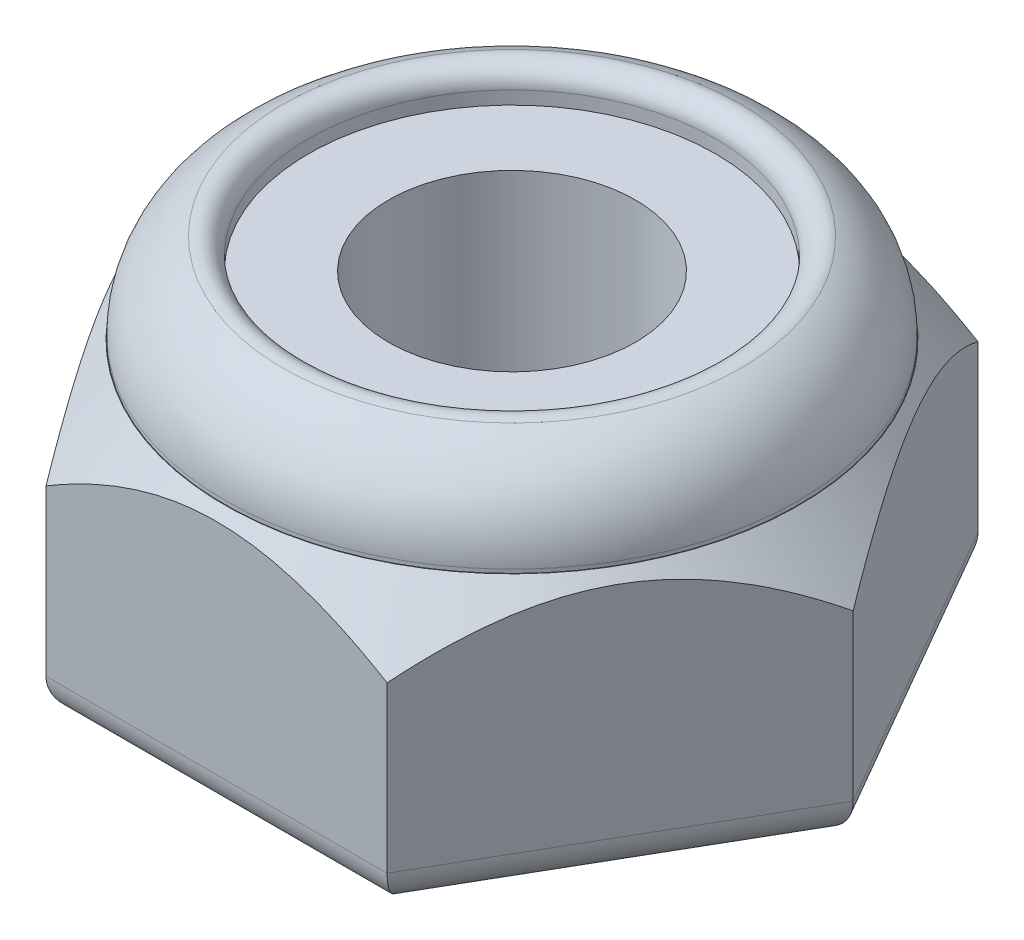
ISO-10303-21;
HEADER;
FILE_DESCRIPTION(('STEP AP214'),'2;1');
FILE_NAME('part.step','',(''),(''),'','','');
FILE_SCHEMA(('AUTOMOTIVE_DESIGN { 1 0 10303 214 1 1 1 1 }'));
ENDSEC;
DATA;
#1=APPLICATION_CONTEXT('core data for automotive mechanical design processes');
#2=APPLICATION_PROTOCOL_DEFINITION('international standard','automotive_design',2000,#1);
#3=PRODUCT_CONTEXT('',#1,'mechanical');
#4=PRODUCT('Part','Part','',(#3));
#5=PRODUCT_RELATED_PRODUCT_CATEGORY('part','',(#4));
#6=PRODUCT_DEFINITION_FORMATION('','',#4);
#7=PRODUCT_DEFINITION_CONTEXT('part definition',#1,'design');
#8=PRODUCT_DEFINITION('design','',#6,#7);
#9=PRODUCT_DEFINITION_SHAPE('','',#8);
#10=(LENGTH_UNIT() NAMED_UNIT(*) SI_UNIT(.MILLI.,.METRE.));
#11=(NAMED_UNIT(*) PLANE_ANGLE_UNIT() SI_UNIT($,.RADIAN.));
#12=(NAMED_UNIT(*) SI_UNIT($,.STERADIAN.) SOLID_ANGLE_UNIT());
#13=UNCERTAINTY_MEASURE_WITH_UNIT(LENGTH_MEASURE(1.E-05),#10,'distance_accuracy_value','');
#14=(GEOMETRIC_REPRESENTATION_CONTEXT(3) GLOBAL_UNCERTAINTY_ASSIGNED_CONTEXT((#13)) GLOBAL_UNIT_ASSIGNED_CONTEXT((#10,
#11,#12)) REPRESENTATION_CONTEXT('',''));
#15=CARTESIAN_POINT('',(0.,0.,0.));
#16=DIRECTION('',(0.,0.,1.));
#17=DIRECTION('',(1.,0.,0.));
#18=AXIS2_PLACEMENT_3D('',#15,#16,#17);
#19=CARTESIAN_POINT('',(0.,4.9784,0.));
#20=DIRECTION('',(0.,-1.,0.));
#21=DIRECTION('',(0.,0.,-1.));
#22=AXIS2_PLACEMENT_3D('',#19,#20,#21);
#23=CYLINDRICAL_SURFACE('',#22,3.937);
#24=CARTESIAN_POINT('',(0.,3.7084,0.));
#25=DIRECTION('',(0.,1.,0.));
#26=DIRECTION('',(0.,0.,1.));
#27=AXIS2_PLACEMENT_3D('',#24,#25,#26);
#28=CIRCLE('',#27,3.937);
#29=CARTESIAN_POINT('',(0.,3.7084,3.937));
#30=VERTEX_POINT('',#29);
#31=EDGE_CURVE('E249',#30,#30,#28,.T.);
#32=ORIENTED_EDGE('',*,*,#31,.F.);
#33=EDGE_LOOP('',(#32));
#34=FACE_BOUND('',#33,.T.);
#35=CARTESIAN_POINT('',(0.,3.6576,0.));
#36=DIRECTION('',(0.,-1.,0.));
#37=DIRECTION('',(0.,0.,-1.));
#38=AXIS2_PLACEMENT_3D('',#35,#36,#37);
#39=CIRCLE('',#38,3.937);
#40=CARTESIAN_POINT('',(0.,3.6576,-3.937));
#41=VERTEX_POINT('',#40);
#42=EDGE_CURVE('E19',#41,#41,#39,.F.);
#43=ORIENTED_EDGE('',*,*,#42,.T.);
#44=EDGE_LOOP('',(#43));
#45=FACE_BOUND('',#44,.T.);
#46=ADVANCED_FACE('F16',(#34,#45),#23,.T.);
#47=CARTESIAN_POINT('',(0.,3.7084,0.));
#48=DIRECTION('',(0.,1.,0.));
#49=DIRECTION('',(0.,0.,1.));
#50=AXIS2_PLACEMENT_3D('',#47,#48,#49);
#51=TOROIDAL_SURFACE('',#50,2.667,1.27);
#52=ORIENTED_EDGE('',*,*,#31,.T.);
#53=EDGE_LOOP('',(#52));
#54=FACE_BOUND('',#53,.T.);
#55=CARTESIAN_POINT('',(0.,4.88572150982644,0.));
#56=DIRECTION('',(0.,-1.,0.));
#57=DIRECTION('',(0.,0.,-1.));
#58=AXIS2_PLACEMENT_3D('',#55,#56,#57);
#59=CIRCLE('',#58,3.14325);
#60=CARTESIAN_POINT('',(0.,4.88572150982644,-3.14325));
#61=VERTEX_POINT('',#60);
#62=EDGE_CURVE('E243',#61,#61,#59,.F.);
#63=ORIENTED_EDGE('',*,*,#62,.F.);
#64=EDGE_LOOP('',(#63));
#65=FACE_BOUND('',#64,.T.);
#66=ADVANCED_FACE('F134',(#54,#65),#51,.T.);
#67=CARTESIAN_POINT('',(2.34315,3.6576,4.05845484975502));
#68=DIRECTION('',(0.,-1.,0.));
#69=DIRECTION('',(0.,0.,-1.));
#70=AXIS2_PLACEMENT_3D('',#67,#68,#69);
#71=PLANE('',#70);
#72=ORIENTED_EDGE('',*,*,#42,.F.);
#73=EDGE_LOOP('',(#72));
#74=FACE_BOUND('',#73,.T.);
#75=CARTESIAN_POINT('',(0.,3.65760000011051,0.));
#76=DIRECTION('',(0.,-1.,0.));
#77=DIRECTION('',(0.,0.,-1.));
#78=AXIS2_PLACEMENT_3D('',#75,#76,#77);
#79=CIRCLE('',#78,3.94407100938664);
#80=CARTESIAN_POINT('',(0.,3.65760000011051,-3.94407100938664));
#81=VERTEX_POINT('',#80);
#82=EDGE_CURVE('E119',#81,#81,#79,.T.);
#83=ORIENTED_EDGE('',*,*,#82,.F.);
#84=EDGE_LOOP('',(#83));
#85=FACE_BOUND('',#84,.T.);
#86=ADVANCED_FACE('F129',(#74,#85),#71,.F.);
#87=CARTESIAN_POINT('',(0.,4.65025720786115,0.));
#88=DIRECTION('',(0.,-1.,0.));
#89=DIRECTION('',(0.,0.,-1.));
#90=AXIS2_PLACEMENT_3D('',#87,#88,#89);
#91=TOROIDAL_SURFACE('',#90,3.048,0.254);
#92=CARTESIAN_POINT('',(0.,4.65025720786115,0.));
#93=DIRECTION('',(0.,1.,0.));
#94=DIRECTION('',(0.,0.,1.));
#95=AXIS2_PLACEMENT_3D('',#92,#93,#94);
#96=CIRCLE('',#95,2.794);
#97=CARTESIAN_POINT('',(0.,4.65025720786115,2.794));
#98=VERTEX_POINT('',#97);
#99=EDGE_CURVE('E104',#98,#98,#96,.F.);
#100=ORIENTED_EDGE('',*,*,#99,.T.);
#101=EDGE_LOOP('',(#100));
#102=FACE_BOUND('',#101,.T.);
#103=ORIENTED_EDGE('',*,*,#62,.T.);
#104=EDGE_LOOP('',(#103));
#105=FACE_BOUND('',#104,.T.);
#106=ADVANCED_FACE('F125',(#102,#105),#91,.T.);
#107=CARTESIAN_POINT('',(0.,2.76773860969115,0.));
#108=DIRECTION('',(0.,-1.,0.));
#109=DIRECTION('',(0.,0.,-1.));
#110=AXIS2_PLACEMENT_3D('',#107,#108,#109);
#111=CONICAL_SURFACE('',#110,4.69075337389313,0.698131700802158);
#112=CARTESIAN_POINT('',(-4.68630000001476,2.77304593398821,-5.3333815551093E-11));
#113=CARTESIAN_POINT('',(-4.65177717141793,2.81418235889091,0.0597952931149053));
#114=CARTESIAN_POINT('',(-4.61695780288956,2.85432113110728,0.120104208500933));
#115=CARTESIAN_POINT('',(-4.54666264441453,2.93230661020916,0.241858994511412));
#116=CARTESIAN_POINT('',(-4.51118655194523,2.97015222462005,0.303305389120424));
#117=CARTESIAN_POINT('',(-4.40329561885259,3.08018701500149,0.490177966909938));
#118=CARTESIAN_POINT('',(-4.32983334004397,3.14837015576205,0.617418366247689));
#119=CARTESIAN_POINT('',(-4.1797796499728,3.27092778609509,0.877318981315214));
#120=CARTESIAN_POINT('',(-4.10317943932402,3.32525984886677,1.00999443802899));
#121=CARTESIAN_POINT('',(-3.94747591651278,3.41577217646147,1.27968085045525));
#122=CARTESIAN_POINT('',(-3.86837998243724,3.45200143013375,1.4166790269463));
#123=CARTESIAN_POINT('',(-3.73746585196202,3.49372811243502,1.64342895235813));
#124=CARTESIAN_POINT('',(-3.68614686019516,3.50560413715319,1.73231605349153));
#125=CARTESIAN_POINT('',(-3.58316406708587,3.52008140702852,1.91068748346216));
#126=CARTESIAN_POINT('',(-3.53150020834088,3.5226810675312,2.00017191172355));
#127=CARTESIAN_POINT('',(-3.42855034551142,3.51847006524789,2.17848630477643));
#128=CARTESIAN_POINT('',(-3.3772638088531,3.51171021118305,2.26731719201287));
#129=CARTESIAN_POINT('',(-3.27519197708947,3.48921023555424,2.4441107906491));
#130=CARTESIAN_POINT('',(-3.22440670715057,3.4734696654174,2.53207345845939));
#131=CARTESIAN_POINT('',(-3.10963060134479,3.42817062222156,2.73087150520989));
#132=CARTESIAN_POINT('',(-3.04589899577138,3.39598542076133,2.84125788411098));
#133=CARTESIAN_POINT('',(-2.92018166739655,3.32004827846255,3.05900668424801));
#134=CARTESIAN_POINT('',(-2.85819691962206,3.27629001415058,3.16636741668776));
#135=CARTESIAN_POINT('',(-2.735889068299,3.17910361386979,3.37821082934389));
#136=CARTESIAN_POINT('',(-2.67557364738244,3.12563730731956,3.48268020285126));
#137=CARTESIAN_POINT('',(-2.55683004320588,3.01104764609313,3.68835015835892));
#138=CARTESIAN_POINT('',(-2.49840123089761,2.94992687749399,3.78955182990274));
#139=CARTESIAN_POINT('',(-2.42439626092569,2.86741854625153,3.91773219790672));
#140=CARTESIAN_POINT('',(-2.40802320106583,2.84883596648691,3.94609116945937));
#141=CARTESIAN_POINT('',(-2.3754621576302,2.81125673907332,4.00248855103733));
#142=CARTESIAN_POINT('',(-2.35927376441604,2.79226151161516,4.03052767057717));
#143=CARTESIAN_POINT('',(-2.3431499999717,2.77304593399368,4.05845484980404));
#144=B_SPLINE_CURVE_WITH_KNOTS('',3,(#112,#113,#114,#115,#116,#117,#118,#119,#120,#121,#122,
#123,#124,#125,#126,#127,#128,#129,#130,#131,#132,#133,#134,#135,#136,#137,#138,#139,#140,#141,
#142,#143),.UNSPECIFIED.,.F.,.F.,(4,2,2,2,2,2,2,2,2,2,2,2,2,2,2,4),(0.,0.241096809088565,
0.48230758945251,0.967637153847365,1.45443592242802,1.93991010956963,2.24950193433618,
2.5591466432483,2.86711700071403,3.17510274216898,3.56882084711336,3.96275452403261,
4.35827201930639,4.75365624679115,4.86660838982693,4.97921936905084),.UNSPECIFIED.);
#145=CARTESIAN_POINT('',(-4.68630000002839,2.77304593399358,0.));
#146=VERTEX_POINT('',#145);
#147=CARTESIAN_POINT('',(-2.34315000001419,2.77304593399358,4.05845484977959));
#148=VERTEX_POINT('',#147);
#149=EDGE_CURVE('E91',#146,#148,#144,.T.);
#150=ORIENTED_EDGE('',*,*,#149,.T.);
#151=CARTESIAN_POINT('',(-2.34315000005357,2.77304593398822,4.05845484974113));
#152=CARTESIAN_POINT('',(-2.27415972170409,2.81414935271336,4.05845484974989));
#153=CARTESIAN_POINT('',(-2.20457738522044,2.85425669884705,4.05845484975361));
#154=CARTESIAN_POINT('',(-2.06410193528096,2.93218331968193,4.05845484975642));
#155=CARTESIAN_POINT('',(-1.99320821641151,2.9700015013142,4.05845484975551));
#156=CARTESIAN_POINT('',(-1.77754688772429,3.07999086386455,4.05845484975401));
#157=CARTESIAN_POINT('',(-1.63068545869954,3.1481589403704,4.05845484975469));
#158=CARTESIAN_POINT('',(-1.33052752457963,3.27077676919262,4.05845484975534));
#159=CARTESIAN_POINT('',(-1.17720631609342,3.32516696804196,4.0584548497553));
#160=CARTESIAN_POINT('',(-0.865613503807779,3.41574608766059,4.05845484975473));
#161=CARTESIAN_POINT('',(-0.707359229311903,3.45199244874899,4.0584548497542));
#162=CARTESIAN_POINT('',(-0.456822143345071,3.49192146546895,4.05845484975548));
#163=CARTESIAN_POINT('',(-0.365672921156202,3.50290887295604,4.05845484975637));
#164=CARTESIAN_POINT('',(-0.183016322004482,3.51758027913678,4.05845484975366));
#165=CARTESIAN_POINT('',(-0.0915105175250817,3.52128341037061,4.05845484975007));
#166=CARTESIAN_POINT('',(0.104649468641441,3.52128177491765,4.0584548497495));
#167=CARTESIAN_POINT('',(0.209305100872023,3.51643705333648,4.05845484975354));
#168=CARTESIAN_POINT('',(0.417787181909869,3.49730239560235,4.05845484975649));
#169=CARTESIAN_POINT('',(0.521613181352877,3.48300765111694,4.05845484975541));
#170=CARTESIAN_POINT('',(0.728332544913562,3.44553375886282,4.05845484975462));
#171=CARTESIAN_POINT('',(0.831215331558566,3.42229697724238,4.05845484975491));
#172=CARTESIAN_POINT('',(1.03487580391125,3.36791830054733,4.05845484975512));
#173=CARTESIAN_POINT('',(1.13565289468809,3.33677420321768,4.05845484975504));
#174=CARTESIAN_POINT('',(1.33273383822163,3.26838741918099,4.05845484975499));
#175=CARTESIAN_POINT('',(1.42908716226035,3.23128582684656,4.05845484975501));
#176=CARTESIAN_POINT('',(1.61947291708309,3.15151071591982,4.05845484975502));
#177=CARTESIAN_POINT('',(1.71350470709807,3.10883567899407,4.05845484975502));
#178=CARTESIAN_POINT('',(1.89803195382395,3.01941532331662,4.05845484975501));
#179=CARTESIAN_POINT('',(1.98855798046432,2.97273255726059,4.05845484975502));
#180=CARTESIAN_POINT('',(2.16742834958163,2.87556944084479,4.05845484975502));
#181=CARTESIAN_POINT('',(2.25577492892455,2.82509321932285,4.05845484975502));
#182=CARTESIAN_POINT('',(2.34315000005566,2.77304593399424,4.05845484975502));
#183=B_SPLINE_CURVE_WITH_KNOTS('',3,(#151,#152,#153,#154,#155,#156,#157,#158,#159,#160,#161,
#162,#163,#164,#165,#166,#167,#168,#169,#170,#171,#172,#173,#174,#175,#176,#177,#178,#179,#180,
#181,#182),.UNSPECIFIED.,.F.,.F.,(4,2,2,2,2,2,2,2,2,2,2,2,2,2,2,4),(0.,0.24090330355952,
0.481920744736242,0.967059466968448,1.4542606837498,1.93990959177135,2.21507934695766,
2.4895253838939,2.80337599596431,3.11738642360394,3.43345557972405,3.74961286055439,
4.0591611810716,4.36879400620232,4.67425708545867,4.97939238068026),.UNSPECIFIED.);
#184=CARTESIAN_POINT('',(2.34315000001419,2.77304593399358,4.05845484977959));
#185=VERTEX_POINT('',#184);
#186=EDGE_CURVE('E83',#148,#185,#183,.T.);
#187=ORIENTED_EDGE('',*,*,#186,.T.);
#188=CARTESIAN_POINT('',(2.3431499999612,2.77304593398822,4.05845484979446));
#189=CARTESIAN_POINT('',(2.37767282857321,2.81418235889091,3.99865955663499));
#190=CARTESIAN_POINT('',(2.41249219710801,2.85432113110729,3.93835064125267));
#191=CARTESIAN_POINT('',(2.48278735558791,2.93230661020917,3.816595855245));
#192=CARTESIAN_POINT('',(2.51826344805563,2.97015222462005,3.75514946063508));
#193=CARTESIAN_POINT('',(2.62615438114571,3.08018701500149,3.56827688284408));
#194=CARTESIAN_POINT('',(2.69961665995557,3.14837015576206,3.44103648350706));
#195=CARTESIAN_POINT('',(2.84967035002766,3.2709277860951,3.18113586844006));
#196=CARTESIAN_POINT('',(2.9262705606761,3.32525984886677,3.04846041172609));
#197=CARTESIAN_POINT('',(3.08197408348711,3.41577217646148,2.77877399929969));
#198=CARTESIAN_POINT('',(3.16107001756274,3.45200143013376,2.64177582280869));
#199=CARTESIAN_POINT('',(3.291984148038,3.49372811243503,2.41502589739689));
#200=CARTESIAN_POINT('',(3.34330313980485,3.50560413715319,2.32613879626348));
#201=CARTESIAN_POINT('',(3.44628593291413,3.52008140702853,2.14776736629285));
#202=CARTESIAN_POINT('',(3.49794979165912,3.52268106753121,2.05828293803146));
#203=CARTESIAN_POINT('',(3.60089965448859,3.51847006524789,1.87996854497858));
#204=CARTESIAN_POINT('',(3.6521861911469,3.51171021118306,1.79113765774214));
#205=CARTESIAN_POINT('',(3.75425802291053,3.48921023555425,1.61434405910591));
#206=CARTESIAN_POINT('',(3.80504329284943,3.47346966541741,1.52638139129562));
#207=CARTESIAN_POINT('',(3.91981939865521,3.42817062222156,1.32758334454512));
#208=CARTESIAN_POINT('',(3.98355100422862,3.39598542076133,1.21719696564403));
#209=CARTESIAN_POINT('',(4.10926833260345,3.32004827846255,0.999448165506999));
#210=CARTESIAN_POINT('',(4.17125308037794,3.27629001415058,0.892087433067251));
#211=CARTESIAN_POINT('',(4.293560931701,3.17910361386979,0.680244020411125));
#212=CARTESIAN_POINT('',(4.35387635261756,3.12563730731956,0.575774646903749));
#213=CARTESIAN_POINT('',(4.47261995679412,3.01104764609313,0.370104691396086));
#214=CARTESIAN_POINT('',(4.53104876910239,2.94992687749399,0.268903019852268));
#215=CARTESIAN_POINT('',(4.60505373907431,2.86741854625153,0.140722651848287));
#216=CARTESIAN_POINT('',(4.62142679893417,2.84883596648691,0.112363680295636));
#217=CARTESIAN_POINT('',(4.6539878423698,2.81125673907332,0.055966298717677));
#218=CARTESIAN_POINT('',(4.67017623558396,2.79226151161516,0.0279271791778412));
#219=CARTESIAN_POINT('',(4.6863000000283,2.77304593399368,-4.90273860582746E-11));
#220=B_SPLINE_CURVE_WITH_KNOTS('',3,(#188,#189,#190,#191,#192,#193,#194,#195,#196,#197,#198,
#199,#200,#201,#202,#203,#204,#205,#206,#207,#208,#209,#210,#211,#212,#213,#214,#215,#216,#217,
#218,#219),.UNSPECIFIED.,.F.,.F.,(4,2,2,2,2,2,2,2,2,2,2,2,2,2,2,4),(0.,0.241096809088565,
0.48230758945251,0.967637153847363,1.45443592242802,1.93991010956962,2.24950193433617,
2.5591466432483,2.86711700071402,3.17510274216897,3.56882084711335,3.9627545240326,
4.35827201930639,4.75365624679114,4.86660838982692,4.97921936905084),.UNSPECIFIED.);
#221=CARTESIAN_POINT('',(4.68630000001419,2.7730459340105,-2.45821360759307E-11));
#222=VERTEX_POINT('',#221);
#223=EDGE_CURVE('E88',#185,#222,#220,.T.);
#224=ORIENTED_EDGE('',*,*,#223,.T.);
#225=CARTESIAN_POINT('',(4.68630000001476,2.77304593398822,5.33267015141622E-11));
#226=CARTESIAN_POINT('',(4.65177717141792,2.81418235889091,-0.0597952931149122));
#227=CARTESIAN_POINT('',(4.61695780288956,2.85432113110729,-0.12010420850094));
#228=CARTESIAN_POINT('',(4.54666264441452,2.93230661020917,-0.241858994511418));
#229=CARTESIAN_POINT('',(4.51118655194522,2.97015222462005,-0.303305389120429));
#230=CARTESIAN_POINT('',(4.40329561885258,3.0801870150015,-0.490177966909942));
#231=CARTESIAN_POINT('',(4.32983334004397,3.14837015576206,-0.617418366247694));
#232=CARTESIAN_POINT('',(4.1797796499728,3.27092778609509,-0.877318981315217));
#233=CARTESIAN_POINT('',(4.10317943932402,3.32525984886677,-1.00999443802899));
#234=CARTESIAN_POINT('',(3.94747591651277,3.41577217646148,-1.27968085045525));
#235=CARTESIAN_POINT('',(3.86837998243724,3.45200143013375,-1.4166790269463));
#236=CARTESIAN_POINT('',(3.73746585196202,3.49372811243502,-1.64342895235813));
#237=CARTESIAN_POINT('',(3.68614686019516,3.50560413715319,-1.73231605349153));
#238=CARTESIAN_POINT('',(3.58316406708587,3.52008140702852,-1.91068748346216));
#239=CARTESIAN_POINT('',(3.53150020834088,3.5226810675312,-2.00017191172355));
#240=CARTESIAN_POINT('',(3.42855034551142,3.51847006524789,-2.17848630477643));
#241=CARTESIAN_POINT('',(3.3772638088531,3.51171021118306,-2.26731719201287));
#242=CARTESIAN_POINT('',(3.27519197708948,3.48921023555424,-2.4441107906491));
#243=CARTESIAN_POINT('',(3.22440670715057,3.4734696654174,-2.53207345845939));
#244=CARTESIAN_POINT('',(3.10963060134479,3.42817062222156,-2.73087150520989));
#245=CARTESIAN_POINT('',(3.04589899577138,3.39598542076133,-2.84125788411098));
#246=CARTESIAN_POINT('',(2.92018166739655,3.32004827846255,-3.05900668424801));
#247=CARTESIAN_POINT('',(2.85819691962206,3.27629001415058,-3.16636741668776));
#248=CARTESIAN_POINT('',(2.735889068299,3.17910361386979,-3.37821082934388));
#249=CARTESIAN_POINT('',(2.67557364738245,3.12563730731956,-3.48268020285126));
#250=CARTESIAN_POINT('',(2.55683004320588,3.01104764609313,-3.68835015835892));
#251=CARTESIAN_POINT('',(2.49840123089762,2.94992687749399,-3.78955182990274));
#252=CARTESIAN_POINT('',(2.42439626092569,2.86741854625153,-3.91773219790672));
#253=CARTESIAN_POINT('',(2.40802320106583,2.84883596648691,-3.94609116945937));
#254=CARTESIAN_POINT('',(2.3754621576302,2.81125673907332,-4.00248855103733));
#255=CARTESIAN_POINT('',(2.35927376441604,2.79226151161516,-4.03052767057717));
#256=CARTESIAN_POINT('',(2.3431499999717,2.77304593399368,-4.05845484980404));
#257=B_SPLINE_CURVE_WITH_KNOTS('',3,(#225,#226,#227,#228,#229,#230,#231,#232,#233,#234,#235,
#236,#237,#238,#239,#240,#241,#242,#243,#244,#245,#246,#247,#248,#249,#250,#251,#252,#253,#254,
#255,#256),.UNSPECIFIED.,.F.,.F.,(4,2,2,2,2,2,2,2,2,2,2,2,2,2,2,4),(0.,0.241096809088564,
0.482307589452508,0.96763715384736,1.45443592242801,1.93991010956962,2.24950193433616,
2.55914664324829,2.86711700071401,3.17510274216896,3.56882084711335,3.96275452403259,
4.35827201930638,4.75365624679113,4.86660838982692,4.97921936905084),.UNSPECIFIED.);
#258=CARTESIAN_POINT('',(2.34315000001419,2.77304593399358,-4.0584548497796));
#259=VERTEX_POINT('',#258);
#260=EDGE_CURVE('E193',#222,#259,#257,.T.);
#261=ORIENTED_EDGE('',*,*,#260,.T.);
#262=CARTESIAN_POINT('',(2.34315000005357,2.77304593398821,-4.05845484974114));
#263=CARTESIAN_POINT('',(2.27415972170409,2.81414935271335,-4.05845484974989));
#264=CARTESIAN_POINT('',(2.20457738522045,2.85425669884704,-4.05845484975361));
#265=CARTESIAN_POINT('',(2.06410193528096,2.93218331968193,-4.05845484975643));
#266=CARTESIAN_POINT('',(1.99320821641151,2.97000150131419,-4.05845484975552));
#267=CARTESIAN_POINT('',(1.77754688772429,3.07999086386454,-4.05845484975402));
#268=CARTESIAN_POINT('',(1.63068545869954,3.1481589403704,-4.0584548497547));
#269=CARTESIAN_POINT('',(1.33052752457963,3.27077676919261,-4.05845484975534));
#270=CARTESIAN_POINT('',(1.17720631609342,3.32516696804195,-4.0584548497553));
#271=CARTESIAN_POINT('',(0.865613503807778,3.41574608766058,-4.05845484975474));
#272=CARTESIAN_POINT('',(0.707359229311901,3.45199244874898,-4.0584548497542));
#273=CARTESIAN_POINT('',(0.456822143345069,3.49192146546895,-4.05845484975548));
#274=CARTESIAN_POINT('',(0.365672921156201,3.50290887295604,-4.05845484975637));
#275=CARTESIAN_POINT('',(0.183016322004481,3.51758027913677,-4.05845484975367));
#276=CARTESIAN_POINT('',(0.0915105175250814,3.5212834103706,-4.05845484975008));
#277=CARTESIAN_POINT('',(-0.104649468641441,3.52128177491764,-4.0584548497495));
#278=CARTESIAN_POINT('',(-0.209305100872023,3.51643705333648,-4.05845484975354));
#279=CARTESIAN_POINT('',(-0.41778718190987,3.49730239560234,-4.0584548497565));
#280=CARTESIAN_POINT('',(-0.521613181352877,3.48300765111693,-4.05845484975542));
#281=CARTESIAN_POINT('',(-0.728332544913562,3.44553375886281,-4.05845484975462));
#282=CARTESIAN_POINT('',(-0.831215331558566,3.42229697724237,-4.05845484975491));
#283=CARTESIAN_POINT('',(-1.03487580391125,3.36791830054732,-4.05845484975513));
#284=CARTESIAN_POINT('',(-1.13565289468809,3.33677420321767,-4.05845484975505));
#285=CARTESIAN_POINT('',(-1.33273383822163,3.26838741918098,-4.05845484975499));
#286=CARTESIAN_POINT('',(-1.42908716226035,3.23128582684655,-4.05845484975501));
#287=CARTESIAN_POINT('',(-1.61947291708309,3.15151071591982,-4.05845484975503));
#288=CARTESIAN_POINT('',(-1.71350470709807,3.10883567899406,-4.05845484975502));
#289=CARTESIAN_POINT('',(-1.89803195382395,3.01941532331662,-4.05845484975502));
#290=CARTESIAN_POINT('',(-1.98855798046431,2.97273255726059,-4.05845484975502));
#291=CARTESIAN_POINT('',(-2.16742834958162,2.87556944084479,-4.05845484975502));
#292=CARTESIAN_POINT('',(-2.25577492892455,2.82509321932284,-4.05845484975502));
#293=CARTESIAN_POINT('',(-2.34315000005566,2.77304593399424,-4.05845484975502));
#294=B_SPLINE_CURVE_WITH_KNOTS('',3,(#262,#263,#264,#265,#266,#267,#268,#269,#270,#271,#272,
#273,#274,#275,#276,#277,#278,#279,#280,#281,#282,#283,#284,#285,#286,#287,#288,#289,#290,#291,
#292,#293),.UNSPECIFIED.,.F.,.F.,(4,2,2,2,2,2,2,2,2,2,2,2,2,2,2,4),(0.,0.24090330355952,
0.481920744736243,0.96705946696845,1.4542606837498,1.93990959177135,2.21507934695766,
2.48952538389391,2.80337599596432,3.11738642360394,3.43345557972405,3.74961286055439,
4.0591611810716,4.36879400620232,4.67425708545866,4.97939238068026),.UNSPECIFIED.);
#295=CARTESIAN_POINT('',(-2.34315000001419,2.77304593399358,-4.0584548497796));
#296=VERTEX_POINT('',#295);
#297=EDGE_CURVE('E204',#259,#296,#294,.T.);
#298=ORIENTED_EDGE('',*,*,#297,.T.);
#299=CARTESIAN_POINT('',(-2.3431499999612,2.77304593398821,-4.05845484979447));
#300=CARTESIAN_POINT('',(-2.37767282857321,2.81418235889091,-3.99865955663499));
#301=CARTESIAN_POINT('',(-2.41249219710802,2.85432113110728,-3.93835064125268));
#302=CARTESIAN_POINT('',(-2.48278735558791,2.93230661020916,-3.81659585524501));
#303=CARTESIAN_POINT('',(-2.51826344805563,2.97015222462005,-3.75514946063508));
#304=CARTESIAN_POINT('',(-2.62615438114571,3.08018701500149,-3.56827688284409));
#305=CARTESIAN_POINT('',(-2.69961665995557,3.14837015576205,-3.44103648350706));
#306=CARTESIAN_POINT('',(-2.84967035002766,3.27092778609509,-3.18113586844007));
#307=CARTESIAN_POINT('',(-2.9262705606761,3.32525984886676,-3.0484604117261));
#308=CARTESIAN_POINT('',(-3.08197408348711,3.41577217646147,-2.7787739992997));
#309=CARTESIAN_POINT('',(-3.16107001756274,3.45200143013375,-2.6417758228087));
#310=CARTESIAN_POINT('',(-3.291984148038,3.49372811243502,-2.4150258973969));
#311=CARTESIAN_POINT('',(-3.34330313980485,3.50560413715318,-2.32613879626349));
#312=CARTESIAN_POINT('',(-3.44628593291413,3.52008140702852,-2.14776736629286));
#313=CARTESIAN_POINT('',(-3.49794979165912,3.5226810675312,-2.05828293803147));
#314=CARTESIAN_POINT('',(-3.60089965448859,3.51847006524788,-1.87996854497859));
#315=CARTESIAN_POINT('',(-3.6521861911469,3.51171021118305,-1.79113765774214));
#316=CARTESIAN_POINT('',(-3.75425802291053,3.48921023555424,-1.61434405910592));
#317=CARTESIAN_POINT('',(-3.80504329284944,3.4734696654174,-1.52638139129563));
#318=CARTESIAN_POINT('',(-3.91981939865521,3.42817062222155,-1.32758334454512));
#319=CARTESIAN_POINT('',(-3.98355100422863,3.39598542076132,-1.21719696564403));
#320=CARTESIAN_POINT('',(-4.10926833260346,3.32004827846254,-0.999448165507007));
#321=CARTESIAN_POINT('',(-4.17125308037794,3.27629001415057,-0.892087433067258));
#322=CARTESIAN_POINT('',(-4.29356093170101,3.17910361386978,-0.680244020411132));
#323=CARTESIAN_POINT('',(-4.35387635261756,3.12563730731955,-0.575774646903757));
#324=CARTESIAN_POINT('',(-4.47261995679413,3.01104764609312,-0.370104691396094));
#325=CARTESIAN_POINT('',(-4.53104876910239,2.94992687749399,-0.268903019852276));
#326=CARTESIAN_POINT('',(-4.60505373907432,2.86741854625152,-0.140722651848295));
#327=CARTESIAN_POINT('',(-4.62142679893418,2.84883596648691,-0.112363680295645));
#328=CARTESIAN_POINT('',(-4.6539878423698,2.81125673907331,-0.0559662987176857));
#329=CARTESIAN_POINT('',(-4.67017623558397,2.79226151161515,-0.0279271791778497));
#330=CARTESIAN_POINT('',(-4.68630000002831,2.77304593399367,4.90190782069009E-11));
#331=B_SPLINE_CURVE_WITH_KNOTS('',3,(#299,#300,#301,#302,#303,#304,#305,#306,#307,#308,#309,
#310,#311,#312,#313,#314,#315,#316,#317,#318,#319,#320,#321,#322,#323,#324,#325,#326,#327,#328,
#329,#330),.UNSPECIFIED.,.F.,.F.,(4,2,2,2,2,2,2,2,2,2,2,2,2,2,2,4),(0.,0.241096809088564,
0.482307589452509,0.967637153847362,1.45443592242802,1.93991010956962,2.24950193433617,
2.5591466432483,2.86711700071402,3.17510274216897,3.56882084711335,3.9627545240326,
4.35827201930639,4.75365624679114,4.86660838982692,4.97921936905084),.UNSPECIFIED.);
#332=EDGE_CURVE('E211',#296,#146,#331,.T.);
#333=ORIENTED_EDGE('',*,*,#332,.T.);
#334=EDGE_LOOP('',(#150,#187,#224,#261,#298,#333));
#335=FACE_BOUND('',#334,.T.);
#336=ORIENTED_EDGE('',*,*,#82,.T.);
#337=EDGE_LOOP('',(#336));
#338=FACE_BOUND('',#337,.T.);
#339=ADVANCED_FACE('F85',(#335,#338),#111,.T.);
#340=CARTESIAN_POINT('',(0.,4.4704,0.));
#341=DIRECTION('',(0.,1.,0.));
#342=DIRECTION('',(0.,0.,1.));
#343=AXIS2_PLACEMENT_3D('',#340,#341,#342);
#344=CYLINDRICAL_SURFACE('',#343,2.794);
#345=ORIENTED_EDGE('',*,*,#99,.F.);
#346=EDGE_LOOP('',(#345));
#347=FACE_BOUND('',#346,.T.);
#348=CARTESIAN_POINT('',(0.,4.4704,0.));
#349=DIRECTION('',(0.,1.,0.));
#350=DIRECTION('',(0.,0.,1.));
#351=AXIS2_PLACEMENT_3D('',#348,#349,#350);
#352=CIRCLE('',#351,2.794);
#353=CARTESIAN_POINT('',(0.,4.4704,2.794));
#354=VERTEX_POINT('',#353);
#355=EDGE_CURVE('E202',#354,#354,#352,.T.);
#356=ORIENTED_EDGE('',*,*,#355,.F.);
#357=EDGE_LOOP('',(#356));
#358=FACE_BOUND('',#357,.T.);
#359=ADVANCED_FACE('F411',(#347,#358),#344,.F.);
#360=CARTESIAN_POINT('',(2.34315,3.6576,4.05845484975502));
#361=DIRECTION('',(-0.866025403784439,0.,-0.499999999999999));
#362=DIRECTION('',(-0.499999999999999,0.,0.866025403784439));
#363=AXIS2_PLACEMENT_3D('',#360,#361,#362);
#364=PLANE('',#363);
#365=DIRECTION('',(-0.499999999999999,0.,0.866025403784439));
#366=VECTOR('',#365,1.);
#367=CARTESIAN_POINT('',(2.34315,0.508,4.05845484975502));
#368=LINE('',#367,#366);
#369=CARTESIAN_POINT('',(4.6863,0.508,0.));
#370=VERTEX_POINT('',#369);
#371=CARTESIAN_POINT('',(2.34315000000001,0.508,4.05845484975502));
#372=VERTEX_POINT('',#371);
#373=EDGE_CURVE('E273',#370,#372,#368,.T.);
#374=ORIENTED_EDGE('',*,*,#373,.F.);
#375=DIRECTION('',(0.,1.,0.));
#376=VECTOR('',#375,1.);
#377=CARTESIAN_POINT('',(4.6863,3.6576,0.));
#378=LINE('',#377,#376);
#379=EDGE_CURVE('E102',#370,#222,#378,.T.);
#380=ORIENTED_EDGE('',*,*,#379,.T.);
#381=ORIENTED_EDGE('',*,*,#223,.F.);
#382=DIRECTION('',(0.,1.,0.));
#383=VECTOR('',#382,1.);
#384=CARTESIAN_POINT('',(2.34315000000001,3.6576,4.05845484975502));
#385=LINE('',#384,#383);
#386=EDGE_CURVE('E95',#185,#372,#385,.F.);
#387=ORIENTED_EDGE('',*,*,#386,.T.);
#388=EDGE_LOOP('',(#374,#380,#381,#387));
#389=FACE_BOUND('',#388,.T.);
#390=ADVANCED_FACE('F99',(#389),#364,.F.);
#391=CARTESIAN_POINT('',(-2.34315,3.6576,4.05845484975501));
#392=DIRECTION('',(0.,0.,-1.));
#393=DIRECTION('',(-1.,0.,0.));
#394=AXIS2_PLACEMENT_3D('',#391,#392,#393);
#395=PLANE('',#394);
#396=DIRECTION('',(-1.,0.,0.));
#397=VECTOR('',#396,1.);
#398=CARTESIAN_POINT('',(-2.34315,0.508,4.05845484975501));
#399=LINE('',#398,#397);
#400=CARTESIAN_POINT('',(-2.34315,0.508,4.05845484975501));
#401=VERTEX_POINT('',#400);
#402=EDGE_CURVE('E109',#372,#401,#399,.T.);
#403=ORIENTED_EDGE('',*,*,#402,.F.);
#404=ORIENTED_EDGE('',*,*,#386,.F.);
#405=ORIENTED_EDGE('',*,*,#186,.F.);
#406=DIRECTION('',(0.,1.,0.));
#407=VECTOR('',#406,1.);
#408=CARTESIAN_POINT('',(-2.34315,3.6576,4.05845484975501));
#409=LINE('',#408,#407);
#410=EDGE_CURVE('E112',#148,#401,#409,.F.);
#411=ORIENTED_EDGE('',*,*,#410,.T.);
#412=EDGE_LOOP('',(#403,#404,#405,#411));
#413=FACE_BOUND('',#412,.T.);
#414=ADVANCED_FACE('F107',(#413),#395,.F.);
#415=CARTESIAN_POINT('',(-4.6863,3.6576,0.));
#416=DIRECTION('',(0.866025403784439,0.,-0.5));
#417=DIRECTION('',(-0.5,0.,-0.866025403784439));
#418=AXIS2_PLACEMENT_3D('',#415,#416,#417);
#419=PLANE('',#418);
#420=DIRECTION('',(-0.5,0.,-0.866025403784439));
#421=VECTOR('',#420,1.);
#422=CARTESIAN_POINT('',(-4.6863,0.508,0.));
#423=LINE('',#422,#421);
#424=CARTESIAN_POINT('',(-4.6863,0.508,0.));
#425=VERTEX_POINT('',#424);
#426=EDGE_CURVE('E269',#401,#425,#423,.T.);
#427=ORIENTED_EDGE('',*,*,#426,.F.);
#428=ORIENTED_EDGE('',*,*,#410,.F.);
#429=ORIENTED_EDGE('',*,*,#149,.F.);
#430=DIRECTION('',(0.,1.,0.));
#431=VECTOR('',#430,1.);
#432=CARTESIAN_POINT('',(-4.6863,3.6576,0.));
#433=LINE('',#432,#431);
#434=EDGE_CURVE('E210',#146,#425,#433,.F.);
#435=ORIENTED_EDGE('',*,*,#434,.T.);
#436=EDGE_LOOP('',(#427,#428,#429,#435));
#437=FACE_BOUND('',#436,.T.);
#438=ADVANCED_FACE('F224',(#437),#419,.F.);
#439=CARTESIAN_POINT('',(-2.34315,3.6576,-4.05845484975502));
#440=DIRECTION('',(0.866025403784438,0.,0.5));
#441=DIRECTION('',(0.5,0.,-0.866025403784438));
#442=AXIS2_PLACEMENT_3D('',#439,#440,#441);
#443=PLANE('',#442);
#444=DIRECTION('',(0.5,0.,-0.866025403784438));
#445=VECTOR('',#444,1.);
#446=CARTESIAN_POINT('',(-2.34315,0.508,-4.05845484975502));
#447=LINE('',#446,#445);
#448=CARTESIAN_POINT('',(-2.34315,0.508,-4.05845484975502));
#449=VERTEX_POINT('',#448);
#450=EDGE_CURVE('E265',#425,#449,#447,.T.);
#451=ORIENTED_EDGE('',*,*,#450,.F.);
#452=ORIENTED_EDGE('',*,*,#434,.F.);
#453=ORIENTED_EDGE('',*,*,#332,.F.);
#454=DIRECTION('',(0.,1.,0.));
#455=VECTOR('',#454,1.);
#456=CARTESIAN_POINT('',(-2.34315,3.6576,-4.05845484975502));
#457=LINE('',#456,#455);
#458=EDGE_CURVE('E201',#296,#449,#457,.F.);
#459=ORIENTED_EDGE('',*,*,#458,.T.);
#460=EDGE_LOOP('',(#451,#452,#453,#459));
#461=FACE_BOUND('',#460,.T.);
#462=ADVANCED_FACE('F221',(#461),#443,.F.);
#463=CARTESIAN_POINT('',(2.34315,3.6576,-4.05845484975502));
#464=DIRECTION('',(0.,0.,1.));
#465=DIRECTION('',(1.,0.,0.));
#466=AXIS2_PLACEMENT_3D('',#463,#464,#465);
#467=PLANE('',#466);
#468=DIRECTION('',(1.,0.,0.));
#469=VECTOR('',#468,1.);
#470=CARTESIAN_POINT('',(2.34315,0.508,-4.05845484975502));
#471=LINE('',#470,#469);
#472=CARTESIAN_POINT('',(2.34315,0.508,-4.05845484975502));
#473=VERTEX_POINT('',#472);
#474=EDGE_CURVE('E261',#449,#473,#471,.T.);
#475=ORIENTED_EDGE('',*,*,#474,.F.);
#476=ORIENTED_EDGE('',*,*,#458,.F.);
#477=ORIENTED_EDGE('',*,*,#297,.F.);
#478=DIRECTION('',(0.,1.,0.));
#479=VECTOR('',#478,1.);
#480=CARTESIAN_POINT('',(2.34315,3.6576,-4.05845484975501));
#481=LINE('',#480,#479);
#482=EDGE_CURVE('E200',#259,#473,#481,.F.);
#483=ORIENTED_EDGE('',*,*,#482,.T.);
#484=EDGE_LOOP('',(#475,#476,#477,#483));
#485=FACE_BOUND('',#484,.T.);
#486=ADVANCED_FACE('F188',(#485),#467,.F.);
#487=CARTESIAN_POINT('',(4.6863,3.6576,0.));
#488=DIRECTION('',(-0.866025403784439,0.,0.5));
#489=DIRECTION('',(0.5,0.,0.866025403784439));
#490=AXIS2_PLACEMENT_3D('',#487,#488,#489);
#491=PLANE('',#490);
#492=DIRECTION('',(0.5,0.,0.866025403784439));
#493=VECTOR('',#492,1.);
#494=CARTESIAN_POINT('',(4.6863,0.508,0.));
#495=LINE('',#494,#493);
#496=EDGE_CURVE('E259',#473,#370,#495,.T.);
#497=ORIENTED_EDGE('',*,*,#496,.F.);
#498=ORIENTED_EDGE('',*,*,#482,.F.);
#499=ORIENTED_EDGE('',*,*,#260,.F.);
#500=ORIENTED_EDGE('',*,*,#379,.F.);
#501=EDGE_LOOP('',(#497,#498,#499,#500));
#502=FACE_BOUND('',#501,.T.);
#503=ADVANCED_FACE('F183',(#502),#491,.F.);
#504=CARTESIAN_POINT('',(0.,4.4704,0.));
#505=DIRECTION('',(0.,1.,0.));
#506=DIRECTION('',(0.,0.,1.));
#507=AXIS2_PLACEMENT_3D('',#504,#505,#506);
#508=PLANE('',#507);
#509=CARTESIAN_POINT('',(0.,4.4704,0.));
#510=DIRECTION('',(0.,1.,0.));
#511=DIRECTION('',(0.,0.,1.));
#512=AXIS2_PLACEMENT_3D('',#509,#510,#511);
#513=CIRCLE('',#512,1.69545);
#514=CARTESIAN_POINT('',(0.,4.4704,1.69545));
#515=VERTEX_POINT('',#514);
#516=EDGE_CURVE('E252',#515,#515,#513,.F.);
#517=ORIENTED_EDGE('',*,*,#516,.T.);
#518=EDGE_LOOP('',(#517));
#519=FACE_BOUND('',#518,.T.);
#520=ORIENTED_EDGE('',*,*,#355,.T.);
#521=EDGE_LOOP('',(#520));
#522=FACE_BOUND('',#521,.T.);
#523=ADVANCED_FACE('F179',(#519,#522),#508,.T.);
#524=CARTESIAN_POINT('',(1.9032090948775,0.508,3.80445484975502));
#525=DIRECTION('',(-0.499999999999999,0.,0.866025403784439));
#526=DIRECTION('',(0.866025403784439,0.,0.499999999999999));
#527=AXIS2_PLACEMENT_3D('',#524,#525,#526);
#528=CYLINDRICAL_SURFACE('',#527,0.508);
#529=CARTESIAN_POINT('',(2.04985606325167,0.508,3.55045484975502));
#530=DIRECTION('',(-0.866025403784439,0.,0.5));
#531=DIRECTION('',(-0.5,0.,-0.866025403784439));
#532=AXIS2_PLACEMENT_3D('',#529,#530,#531);
#533=ELLIPSE('',#532,0.58658787349666,0.508);
#534=CARTESIAN_POINT('',(2.04985606325167,0.,3.55045484975502));
#535=VERTEX_POINT('',#534);
#536=EDGE_CURVE('E272',#535,#372,#533,.T.);
#537=ORIENTED_EDGE('',*,*,#536,.F.);
#538=DIRECTION('',(-0.499999999999999,0.,0.866025403784439));
#539=VECTOR('',#538,1.);
#540=CARTESIAN_POINT('',(4.09971212650334,0.,0.));
#541=LINE('',#540,#539);
#542=CARTESIAN_POINT('',(4.09971212650334,0.,0.));
#543=VERTEX_POINT('',#542);
#544=EDGE_CURVE('E255',#543,#535,#541,.T.);
#545=ORIENTED_EDGE('',*,*,#544,.F.);
#546=CARTESIAN_POINT('',(4.09971212650334,0.508,0.));
#547=DIRECTION('',(0.,0.,1.));
#548=DIRECTION('',(1.,0.,0.));
#549=AXIS2_PLACEMENT_3D('',#546,#547,#548);
#550=ELLIPSE('',#549,0.58658787349666,0.508);
#551=EDGE_CURVE('E256',#370,#543,#550,.F.);
#552=ORIENTED_EDGE('',*,*,#551,.F.);
#553=ORIENTED_EDGE('',*,*,#373,.T.);
#554=EDGE_LOOP('',(#537,#545,#552,#553));
#555=FACE_BOUND('',#554,.T.);
#556=ADVANCED_FACE('F175',(#555),#528,.T.);
#557=CARTESIAN_POINT('',(-2.34315,0.508,3.55045484975501));
#558=DIRECTION('',(-1.,0.,0.));
#559=DIRECTION('',(0.,0.,1.));
#560=AXIS2_PLACEMENT_3D('',#557,#558,#559);
#561=CYLINDRICAL_SURFACE('',#560,0.508);
#562=ORIENTED_EDGE('',*,*,#536,.T.);
#563=ORIENTED_EDGE('',*,*,#402,.T.);
#564=CARTESIAN_POINT('',(-2.04985606325167,0.508,3.55045484975501));
#565=DIRECTION('',(-0.866025403784439,0.,-0.5));
#566=DIRECTION('',(0.5,0.,-0.866025403784439));
#567=AXIS2_PLACEMENT_3D('',#564,#565,#566);
#568=ELLIPSE('',#567,0.58658787349666,0.508);
#569=CARTESIAN_POINT('',(-2.04985606325167,0.,3.55045484975502));
#570=VERTEX_POINT('',#569);
#571=EDGE_CURVE('E270',#570,#401,#568,.T.);
#572=ORIENTED_EDGE('',*,*,#571,.F.);
#573=DIRECTION('',(1.,0.,0.));
#574=VECTOR('',#573,1.);
#575=CARTESIAN_POINT('',(2.34315,0.,3.55045484975502));
#576=LINE('',#575,#574);
#577=EDGE_CURVE('E304',#535,#570,#576,.F.);
#578=ORIENTED_EDGE('',*,*,#577,.F.);
#579=EDGE_LOOP('',(#562,#563,#572,#578));
#580=FACE_BOUND('',#579,.T.);
#581=ADVANCED_FACE('F171',(#580),#561,.T.);
#582=CARTESIAN_POINT('',(-4.24635909487751,0.508,-0.254000000000004));
#583=DIRECTION('',(-0.5,0.,-0.866025403784439));
#584=DIRECTION('',(-0.866025403784439,0.,0.5));
#585=AXIS2_PLACEMENT_3D('',#582,#583,#584);
#586=CYLINDRICAL_SURFACE('',#585,0.508);
#587=ORIENTED_EDGE('',*,*,#571,.T.);
#588=ORIENTED_EDGE('',*,*,#426,.T.);
#589=CARTESIAN_POINT('',(-4.09971212650334,0.508,0.));
#590=DIRECTION('',(0.,0.,-1.));
#591=DIRECTION('',(1.,0.,0.));
#592=AXIS2_PLACEMENT_3D('',#589,#590,#591);
#593=ELLIPSE('',#592,0.58658787349666,0.508);
#594=CARTESIAN_POINT('',(-4.09971212650334,0.,0.));
#595=VERTEX_POINT('',#594);
#596=EDGE_CURVE('E266',#595,#425,#593,.T.);
#597=ORIENTED_EDGE('',*,*,#596,.F.);
#598=DIRECTION('',(-0.5,0.,-0.866025403784439));
#599=VECTOR('',#598,1.);
#600=CARTESIAN_POINT('',(-2.04985606325167,0.,3.55045484975501));
#601=LINE('',#600,#599);
#602=EDGE_CURVE('E300',#570,#595,#601,.T.);
#603=ORIENTED_EDGE('',*,*,#602,.F.);
#604=EDGE_LOOP('',(#587,#588,#597,#603));
#605=FACE_BOUND('',#604,.T.);
#606=ADVANCED_FACE('F167',(#605),#586,.T.);
#607=CARTESIAN_POINT('',(-1.90320909487751,0.508,-3.80445484975502));
#608=DIRECTION('',(0.5,0.,-0.866025403784438));
#609=DIRECTION('',(-0.866025403784438,0.,-0.5));
#610=AXIS2_PLACEMENT_3D('',#607,#608,#609);
#611=CYLINDRICAL_SURFACE('',#610,0.508);
#612=ORIENTED_EDGE('',*,*,#596,.T.);
#613=ORIENTED_EDGE('',*,*,#450,.T.);
#614=CARTESIAN_POINT('',(-2.04985606325167,0.508,-3.55045484975502));
#615=DIRECTION('',(0.866025403784439,0.,-0.5));
#616=DIRECTION('',(0.5,0.,0.866025403784439));
#617=AXIS2_PLACEMENT_3D('',#614,#615,#616);
#618=ELLIPSE('',#617,0.58658787349666,0.508);
#619=CARTESIAN_POINT('',(-2.04985606325167,0.,-3.55045484975502));
#620=VERTEX_POINT('',#619);
#621=EDGE_CURVE('E262',#620,#449,#618,.T.);
#622=ORIENTED_EDGE('',*,*,#621,.F.);
#623=DIRECTION('',(0.5,0.,-0.866025403784438));
#624=VECTOR('',#623,1.);
#625=CARTESIAN_POINT('',(-4.09971212650334,0.,0.));
#626=LINE('',#625,#624);
#627=EDGE_CURVE('E296',#595,#620,#626,.T.);
#628=ORIENTED_EDGE('',*,*,#627,.F.);
#629=EDGE_LOOP('',(#612,#613,#622,#628));
#630=FACE_BOUND('',#629,.T.);
#631=ADVANCED_FACE('F164',(#630),#611,.T.);
#632=CARTESIAN_POINT('',(2.34315,0.508,-3.55045484975502));
#633=DIRECTION('',(1.,0.,0.));
#634=DIRECTION('',(0.,0.,-1.));
#635=AXIS2_PLACEMENT_3D('',#632,#633,#634);
#636=CYLINDRICAL_SURFACE('',#635,0.508);
#637=ORIENTED_EDGE('',*,*,#621,.T.);
#638=ORIENTED_EDGE('',*,*,#474,.T.);
#639=CARTESIAN_POINT('',(2.04985606325167,0.508,-3.55045484975502));
#640=DIRECTION('',(0.866025403784439,0.,0.5));
#641=DIRECTION('',(-0.5,0.,0.866025403784439));
#642=AXIS2_PLACEMENT_3D('',#639,#640,#641);
#643=ELLIPSE('',#642,0.58658787349666,0.508);
#644=CARTESIAN_POINT('',(2.04985606325167,0.,-3.55045484975502));
#645=VERTEX_POINT('',#644);
#646=EDGE_CURVE('E34',#645,#473,#643,.T.);
#647=ORIENTED_EDGE('',*,*,#646,.F.);
#648=DIRECTION('',(1.,0.,0.));
#649=VECTOR('',#648,1.);
#650=CARTESIAN_POINT('',(2.34315,0.,-3.55045484975502));
#651=LINE('',#650,#649);
#652=EDGE_CURVE('E299',#620,#645,#651,.T.);
#653=ORIENTED_EDGE('',*,*,#652,.F.);
#654=EDGE_LOOP('',(#637,#638,#647,#653));
#655=FACE_BOUND('',#654,.T.);
#656=ADVANCED_FACE('F160',(#655),#636,.T.);
#657=CARTESIAN_POINT('',(4.2463590948775,0.508,0.253999999999996));
#658=DIRECTION('',(0.5,0.,0.866025403784439));
#659=DIRECTION('',(0.866025403784439,0.,-0.5));
#660=AXIS2_PLACEMENT_3D('',#657,#658,#659);
#661=CYLINDRICAL_SURFACE('',#660,0.508);
#662=ORIENTED_EDGE('',*,*,#551,.T.);
#663=DIRECTION('',(0.5,0.,0.866025403784439));
#664=VECTOR('',#663,1.);
#665=CARTESIAN_POINT('',(2.04985606325167,0.,-3.55045484975502));
#666=LINE('',#665,#664);
#667=EDGE_CURVE('E25',#645,#543,#666,.T.);
#668=ORIENTED_EDGE('',*,*,#667,.F.);
#669=ORIENTED_EDGE('',*,*,#646,.T.);
#670=ORIENTED_EDGE('',*,*,#496,.T.);
#671=EDGE_LOOP('',(#662,#668,#669,#670));
#672=FACE_BOUND('',#671,.T.);
#673=ADVANCED_FACE('F153',(#672),#661,.T.);
#674=CARTESIAN_POINT('',(0.,0.,0.));
#675=DIRECTION('',(0.,1.,0.));
#676=DIRECTION('',(0.,0.,1.));
#677=AXIS2_PLACEMENT_3D('',#674,#675,#676);
#678=CYLINDRICAL_SURFACE('',#677,1.69545);
#679=ORIENTED_EDGE('',*,*,#516,.F.);
#680=EDGE_LOOP('',(#679));
#681=FACE_BOUND('',#680,.T.);
#682=CARTESIAN_POINT('',(0.,0.,0.));
#683=DIRECTION('',(0.,1.,0.));
#684=DIRECTION('',(0.,0.,1.));
#685=AXIS2_PLACEMENT_3D('',#682,#683,#684);
#686=CIRCLE('',#685,1.69545);
#687=CARTESIAN_POINT('',(0.,0.,1.69545));
#688=VERTEX_POINT('',#687);
#689=EDGE_CURVE('E11',#688,#688,#686,.T.);
#690=ORIENTED_EDGE('',*,*,#689,.F.);
#691=EDGE_LOOP('',(#690));
#692=FACE_BOUND('',#691,.T.);
#693=ADVANCED_FACE('F147',(#681,#692),#678,.F.);
#694=CARTESIAN_POINT('',(2.34315,0.,4.05845484975502));
#695=DIRECTION('',(0.,-1.,0.));
#696=DIRECTION('',(0.,0.,-1.));
#697=AXIS2_PLACEMENT_3D('',#694,#695,#696);
#698=PLANE('',#697);
#699=ORIENTED_EDGE('',*,*,#689,.T.);
#700=EDGE_LOOP('',(#699));
#701=FACE_BOUND('',#700,.T.);
#702=ORIENTED_EDGE('',*,*,#652,.T.);
#703=ORIENTED_EDGE('',*,*,#667,.T.);
#704=ORIENTED_EDGE('',*,*,#544,.T.);
#705=ORIENTED_EDGE('',*,*,#577,.T.);
#706=ORIENTED_EDGE('',*,*,#602,.T.);
#707=ORIENTED_EDGE('',*,*,#627,.T.);
#708=EDGE_LOOP('',(#702,#703,#704,#705,#706,#707));
#709=FACE_BOUND('',#708,.T.);
#710=ADVANCED_FACE('F145',(#701,#709),#698,.T.);
#711=CLOSED_SHELL('',(#46,#66,#86,#106,#339,#359,#390,#414,#438,#462,#486,#503,#523,#556,#581,
#606,#631,#656,#673,#693,#710));
#712=MANIFOLD_SOLID_BREP('B1',#711);
#713=ADVANCED_BREP_SHAPE_REPRESENTATION('',(#18,#712),#14);
#714=SHAPE_DEFINITION_REPRESENTATION(#9,#713);
ENDSEC;
END-ISO-10303-21;
